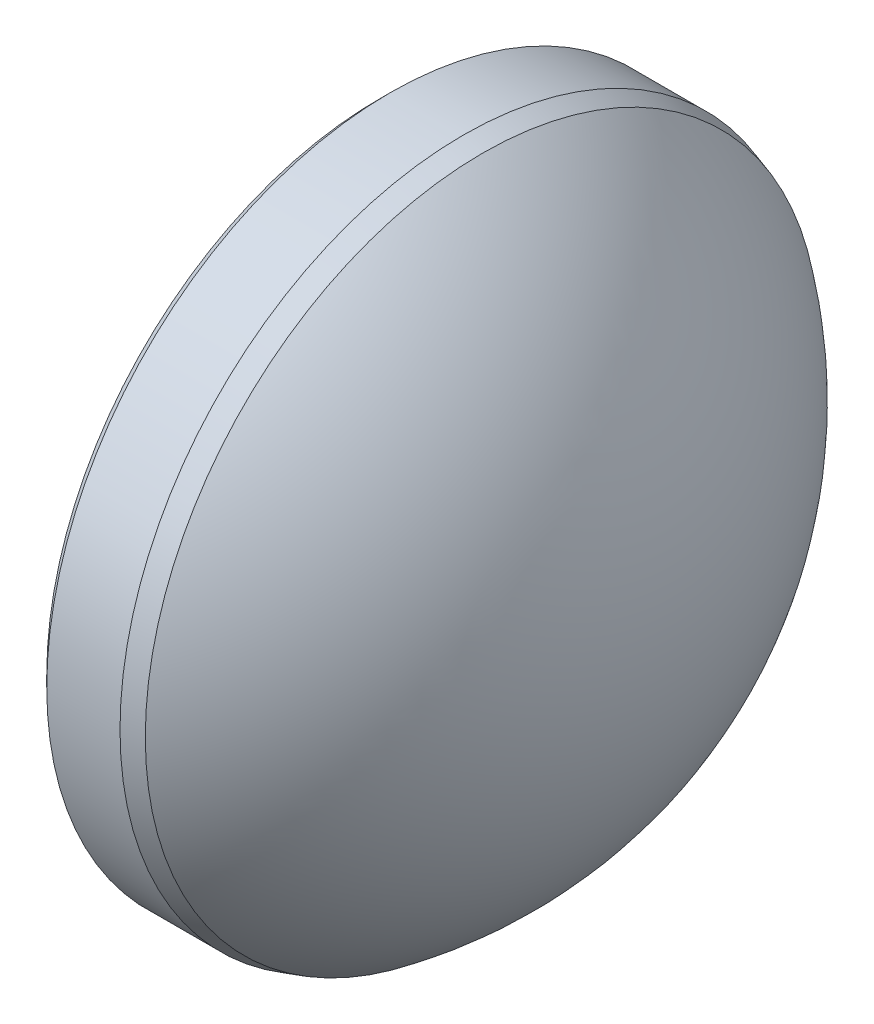
ISO-10303-21;
HEADER;
FILE_DESCRIPTION(('STEP AP214'),'2;1');
FILE_NAME('part.step','',(''),(''),'','','');
FILE_SCHEMA(('AUTOMOTIVE_DESIGN { 1 0 10303 214 1 1 1 1 }'));
ENDSEC;
DATA;
#1=APPLICATION_CONTEXT('core data for automotive mechanical design processes');
#2=APPLICATION_PROTOCOL_DEFINITION('international standard','automotive_design',2000,#1);
#3=PRODUCT_CONTEXT('',#1,'mechanical');
#4=PRODUCT('Part','Part','',(#3));
#5=PRODUCT_RELATED_PRODUCT_CATEGORY('part','',(#4));
#6=PRODUCT_DEFINITION_FORMATION('','',#4);
#7=PRODUCT_DEFINITION_CONTEXT('part definition',#1,'design');
#8=PRODUCT_DEFINITION('design','',#6,#7);
#9=PRODUCT_DEFINITION_SHAPE('','',#8);
#10=(LENGTH_UNIT() NAMED_UNIT(*) SI_UNIT(.MILLI.,.METRE.));
#11=(NAMED_UNIT(*) PLANE_ANGLE_UNIT() SI_UNIT($,.RADIAN.));
#12=(NAMED_UNIT(*) SI_UNIT($,.STERADIAN.) SOLID_ANGLE_UNIT());
#13=UNCERTAINTY_MEASURE_WITH_UNIT(LENGTH_MEASURE(1.E-05),#10,'distance_accuracy_value','');
#14=(GEOMETRIC_REPRESENTATION_CONTEXT(3) GLOBAL_UNCERTAINTY_ASSIGNED_CONTEXT((#13)) GLOBAL_UNIT_ASSIGNED_CONTEXT((#10,
#11,#12)) REPRESENTATION_CONTEXT('',''));
#15=CARTESIAN_POINT('',(0.,0.,0.));
#16=DIRECTION('',(0.,0.,1.));
#17=DIRECTION('',(1.,0.,0.));
#18=AXIS2_PLACEMENT_3D('',#15,#16,#17);
#19=CARTESIAN_POINT('',(-5.15,0.,0.));
#20=DIRECTION('',(1.,0.,0.));
#21=DIRECTION('',(0.,1.,0.));
#22=AXIS2_PLACEMENT_3D('',#19,#20,#21);
#23=SPHERICAL_SURFACE('',#22,7.7);
#24=CARTESIAN_POINT('',(-0.637639802677763,0.,0.));
#25=DIRECTION('',(-1.,0.,0.));
#26=DIRECTION('',(0.,0.,1.));
#27=AXIS2_PLACEMENT_3D('',#24,#25,#26);
#28=CIRCLE('',#27,6.23927924119621);
#29=CARTESIAN_POINT('',(-0.637639802677763,0.,6.23927924119621));
#30=VERTEX_POINT('',#29);
#31=EDGE_CURVE('E28',#30,#30,#28,.F.);
#32=ORIENTED_EDGE('',*,*,#31,.T.);
#33=EDGE_LOOP('',(#32));
#34=FACE_BOUND('',#33,.T.);
#35=ADVANCED_FACE('F13',(#34),#23,.T.);
#36=CARTESIAN_POINT('',(2.55,0.,0.));
#37=DIRECTION('',(1.,0.,0.));
#38=DIRECTION('',(0.,0.,-1.));
#39=AXIS2_PLACEMENT_3D('',#36,#37,#38);
#40=CYLINDRICAL_SURFACE('',#39,6.35);
#41=CARTESIAN_POINT('',(-0.994830657712608,0.,0.));
#42=DIRECTION('',(1.,0.,0.));
#43=DIRECTION('',(0.,0.,-1.));
#44=AXIS2_PLACEMENT_3D('',#41,#42,#43);
#45=CIRCLE('',#44,6.35);
#46=CARTESIAN_POINT('',(-0.994830657712608,0.,-6.35));
#47=VERTEX_POINT('',#46);
#48=EDGE_CURVE('E20',#47,#47,#45,.F.);
#49=ORIENTED_EDGE('',*,*,#48,.T.);
#50=EDGE_LOOP('',(#49));
#51=FACE_BOUND('',#50,.T.);
#52=CARTESIAN_POINT('',(-2.35,0.,0.));
#53=DIRECTION('',(-1.,0.,0.));
#54=DIRECTION('',(0.,0.,1.));
#55=AXIS2_PLACEMENT_3D('',#52,#53,#54);
#56=CIRCLE('',#55,6.35);
#57=CARTESIAN_POINT('',(-2.35,0.,6.35));
#58=VERTEX_POINT('',#57);
#59=EDGE_CURVE('E24',#58,#58,#56,.F.);
#60=ORIENTED_EDGE('',*,*,#59,.T.);
#61=EDGE_LOOP('',(#60));
#62=FACE_BOUND('',#61,.T.);
#63=ADVANCED_FACE('F45',(#51,#62),#40,.T.);
#64=CARTESIAN_POINT('',(-2.55,0.,0.));
#65=DIRECTION('',(-1.,0.,0.));
#66=DIRECTION('',(0.,0.,1.));
#67=AXIS2_PLACEMENT_3D('',#64,#65,#66);
#68=PLANE('',#67);
#69=CARTESIAN_POINT('',(-2.55,0.,0.));
#70=DIRECTION('',(-1.,0.,0.));
#71=DIRECTION('',(0.,0.,1.));
#72=AXIS2_PLACEMENT_3D('',#69,#70,#71);
#73=CIRCLE('',#72,6.15);
#74=CARTESIAN_POINT('',(-2.55,0.,6.15));
#75=VERTEX_POINT('',#74);
#76=EDGE_CURVE('E9',#75,#75,#73,.T.);
#77=ORIENTED_EDGE('',*,*,#76,.T.);
#78=EDGE_LOOP('',(#77));
#79=FACE_BOUND('',#78,.T.);
#80=ADVANCED_FACE('F37',(#79),#68,.T.);
#81=CARTESIAN_POINT('',(-0.637639802677763,0.,0.));
#82=DIRECTION('',(-1.,0.,0.));
#83=DIRECTION('',(0.,0.,1.));
#84=AXIS2_PLACEMENT_3D('',#81,#82,#83);
#85=CONICAL_SURFACE('',#84,6.23927924119622,0.300584198905266);
#86=ORIENTED_EDGE('',*,*,#48,.F.);
#87=EDGE_LOOP('',(#86));
#88=FACE_BOUND('',#87,.T.);
#89=ORIENTED_EDGE('',*,*,#31,.F.);
#90=EDGE_LOOP('',(#89));
#91=FACE_BOUND('',#90,.T.);
#92=ADVANCED_FACE('F35',(#88,#91),#85,.T.);
#93=CARTESIAN_POINT('',(-2.35,0.,0.));
#94=DIRECTION('',(1.,0.,0.));
#95=DIRECTION('',(0.,0.,-1.));
#96=AXIS2_PLACEMENT_3D('',#93,#94,#95);
#97=CONICAL_SURFACE('',#96,6.35,0.785398163397446);
#98=ORIENTED_EDGE('',*,*,#76,.F.);
#99=EDGE_LOOP('',(#98));
#100=FACE_BOUND('',#99,.T.);
#101=ORIENTED_EDGE('',*,*,#59,.F.);
#102=EDGE_LOOP('',(#101));
#103=FACE_BOUND('',#102,.T.);
#104=ADVANCED_FACE('F15',(#100,#103),#97,.T.);
#105=CLOSED_SHELL('',(#35,#63,#80,#92,#104));
#106=MANIFOLD_SOLID_BREP('B1',#105);
#107=ADVANCED_BREP_SHAPE_REPRESENTATION('',(#18,#106),#14);
#108=SHAPE_DEFINITION_REPRESENTATION(#9,#107);
ENDSEC;
END-ISO-10303-21;
